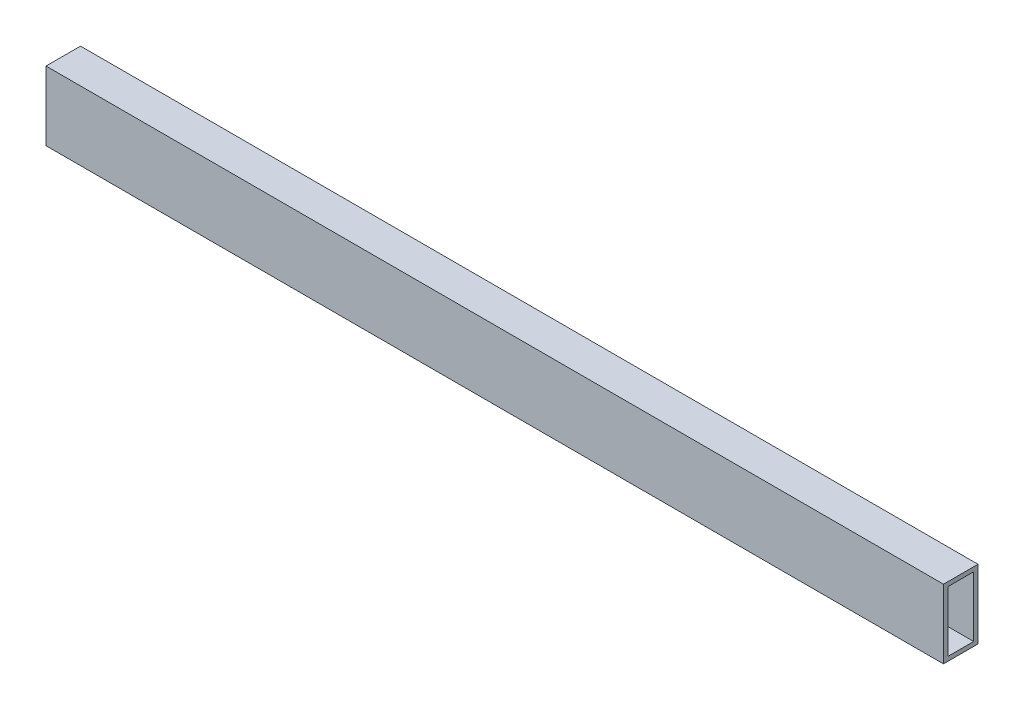
ISO-10303-21;
HEADER;
FILE_DESCRIPTION(('STEP AP214'),'2;1');
FILE_NAME('part.step','',(''),(''),'','','');
FILE_SCHEMA(('AUTOMOTIVE_DESIGN { 1 0 10303 214 1 1 1 1 }'));
ENDSEC;
DATA;
#1=APPLICATION_CONTEXT('core data for automotive mechanical design processes');
#2=APPLICATION_PROTOCOL_DEFINITION('international standard','automotive_design',2000,#1);
#3=PRODUCT_CONTEXT('',#1,'mechanical');
#4=PRODUCT('Part','Part','',(#3));
#5=PRODUCT_RELATED_PRODUCT_CATEGORY('part','',(#4));
#6=PRODUCT_DEFINITION_FORMATION('','',#4);
#7=PRODUCT_DEFINITION_CONTEXT('part definition',#1,'design');
#8=PRODUCT_DEFINITION('design','',#6,#7);
#9=PRODUCT_DEFINITION_SHAPE('','',#8);
#10=(LENGTH_UNIT() NAMED_UNIT(*) SI_UNIT(.MILLI.,.METRE.));
#11=(NAMED_UNIT(*) PLANE_ANGLE_UNIT() SI_UNIT($,.RADIAN.));
#12=(NAMED_UNIT(*) SI_UNIT($,.STERADIAN.) SOLID_ANGLE_UNIT());
#13=UNCERTAINTY_MEASURE_WITH_UNIT(LENGTH_MEASURE(1.E-05),#10,'distance_accuracy_value','');
#14=(GEOMETRIC_REPRESENTATION_CONTEXT(3) GLOBAL_UNCERTAINTY_ASSIGNED_CONTEXT((#13)) GLOBAL_UNIT_ASSIGNED_CONTEXT((#10,
#11,#12)) REPRESENTATION_CONTEXT('',''));
#15=CARTESIAN_POINT('',(0.,0.,0.));
#16=DIRECTION('',(0.,0.,1.));
#17=DIRECTION('',(1.,0.,0.));
#18=AXIS2_PLACEMENT_3D('',#15,#16,#17);
#19=CARTESIAN_POINT('',(330.2,25.4,-12.7));
#20=DIRECTION('',(-1.,0.,0.));
#21=DIRECTION('',(0.,0.,1.));
#22=AXIS2_PLACEMENT_3D('',#19,#20,#21);
#23=PLANE('',#22);
#24=DIRECTION('',(0.,0.,-1.));
#25=VECTOR('',#24,1.);
#26=CARTESIAN_POINT('',(330.2,-25.4,-12.7));
#27=LINE('',#26,#25);
#28=CARTESIAN_POINT('',(330.2,-25.4,12.7));
#29=VERTEX_POINT('',#28);
#30=CARTESIAN_POINT('',(330.2,-25.4,-12.7));
#31=VERTEX_POINT('',#30);
#32=EDGE_CURVE('E127',#29,#31,#27,.T.);
#33=ORIENTED_EDGE('',*,*,#32,.T.);
#34=DIRECTION('',(0.,-1.,0.));
#35=VECTOR('',#34,1.);
#36=CARTESIAN_POINT('',(330.2,25.4,-12.7));
#37=LINE('',#36,#35);
#38=CARTESIAN_POINT('',(330.2,25.4,-12.7));
#39=VERTEX_POINT('',#38);
#40=EDGE_CURVE('E11',#39,#31,#37,.T.);
#41=ORIENTED_EDGE('',*,*,#40,.F.);
#42=DIRECTION('',(0.,0.,-1.));
#43=VECTOR('',#42,1.);
#44=CARTESIAN_POINT('',(330.2,25.4,-12.7));
#45=LINE('',#44,#43);
#46=CARTESIAN_POINT('',(330.2,25.4,12.7));
#47=VERTEX_POINT('',#46);
#48=EDGE_CURVE('E132',#47,#39,#45,.T.);
#49=ORIENTED_EDGE('',*,*,#48,.F.);
#50=DIRECTION('',(0.,-1.,0.));
#51=VECTOR('',#50,1.);
#52=CARTESIAN_POINT('',(330.2,25.4,12.7));
#53=LINE('',#52,#51);
#54=EDGE_CURVE('E142',#47,#29,#53,.T.);
#55=ORIENTED_EDGE('',*,*,#54,.T.);
#56=EDGE_LOOP('',(#33,#41,#49,#55));
#57=FACE_BOUND('',#56,.T.);
#58=DIRECTION('',(0.,0.,-1.));
#59=VECTOR('',#58,1.);
#60=CARTESIAN_POINT('',(330.2,-22.225,-12.7));
#61=LINE('',#60,#59);
#62=CARTESIAN_POINT('',(330.2,-22.225,9.525));
#63=VERTEX_POINT('',#62);
#64=CARTESIAN_POINT('',(330.2,-22.225,-9.525));
#65=VERTEX_POINT('',#64);
#66=EDGE_CURVE('E103',#63,#65,#61,.T.);
#67=ORIENTED_EDGE('',*,*,#66,.F.);
#68=DIRECTION('',(0.,-1.,0.));
#69=VECTOR('',#68,1.);
#70=CARTESIAN_POINT('',(330.2,25.4,9.525));
#71=LINE('',#70,#69);
#72=CARTESIAN_POINT('',(330.2,22.225,9.525));
#73=VERTEX_POINT('',#72);
#74=EDGE_CURVE('E123',#73,#63,#71,.T.);
#75=ORIENTED_EDGE('',*,*,#74,.F.);
#76=DIRECTION('',(0.,0.,-1.));
#77=VECTOR('',#76,1.);
#78=CARTESIAN_POINT('',(330.2,22.225,-12.7));
#79=LINE('',#78,#77);
#80=CARTESIAN_POINT('',(330.2,22.225,-9.525));
#81=VERTEX_POINT('',#80);
#82=EDGE_CURVE('E47',#73,#81,#79,.T.);
#83=ORIENTED_EDGE('',*,*,#82,.T.);
#84=DIRECTION('',(0.,-1.,0.));
#85=VECTOR('',#84,1.);
#86=CARTESIAN_POINT('',(330.2,25.4,-9.525));
#87=LINE('',#86,#85);
#88=EDGE_CURVE('E113',#81,#65,#87,.T.);
#89=ORIENTED_EDGE('',*,*,#88,.T.);
#90=EDGE_LOOP('',(#67,#75,#83,#89));
#91=FACE_BOUND('',#90,.T.);
#92=ADVANCED_FACE('F33',(#57,#91),#23,.F.);
#93=CARTESIAN_POINT('',(-330.2,25.4,-12.7));
#94=DIRECTION('',(1.,0.,0.));
#95=DIRECTION('',(0.,0.,-1.));
#96=AXIS2_PLACEMENT_3D('',#93,#94,#95);
#97=PLANE('',#96);
#98=DIRECTION('',(0.,0.,1.));
#99=VECTOR('',#98,1.);
#100=CARTESIAN_POINT('',(-330.2,-25.4,-12.7));
#101=LINE('',#100,#99);
#102=CARTESIAN_POINT('',(-330.2,-25.4,-12.7));
#103=VERTEX_POINT('',#102);
#104=CARTESIAN_POINT('',(-330.2,-25.4,12.7));
#105=VERTEX_POINT('',#104);
#106=EDGE_CURVE('E147',#103,#105,#101,.T.);
#107=ORIENTED_EDGE('',*,*,#106,.T.);
#108=DIRECTION('',(0.,-1.,0.));
#109=VECTOR('',#108,1.);
#110=CARTESIAN_POINT('',(-330.2,25.4,12.7));
#111=LINE('',#110,#109);
#112=CARTESIAN_POINT('',(-330.2,25.4,12.7));
#113=VERTEX_POINT('',#112);
#114=EDGE_CURVE('E152',#113,#105,#111,.T.);
#115=ORIENTED_EDGE('',*,*,#114,.F.);
#116=DIRECTION('',(0.,0.,1.));
#117=VECTOR('',#116,1.);
#118=CARTESIAN_POINT('',(-330.2,25.4,-12.7));
#119=LINE('',#118,#117);
#120=CARTESIAN_POINT('',(-330.2,25.4,-12.7));
#121=VERTEX_POINT('',#120);
#122=EDGE_CURVE('E138',#121,#113,#119,.T.);
#123=ORIENTED_EDGE('',*,*,#122,.F.);
#124=DIRECTION('',(0.,-1.,0.));
#125=VECTOR('',#124,1.);
#126=CARTESIAN_POINT('',(-330.2,25.4,-12.7));
#127=LINE('',#126,#125);
#128=EDGE_CURVE('E40',#121,#103,#127,.T.);
#129=ORIENTED_EDGE('',*,*,#128,.T.);
#130=EDGE_LOOP('',(#107,#115,#123,#129));
#131=FACE_BOUND('',#130,.T.);
#132=DIRECTION('',(0.,0.,1.));
#133=VECTOR('',#132,1.);
#134=CARTESIAN_POINT('',(-330.2,-22.225,-12.7));
#135=LINE('',#134,#133);
#136=CARTESIAN_POINT('',(-330.2,-22.225,-9.525));
#137=VERTEX_POINT('',#136);
#138=CARTESIAN_POINT('',(-330.2,-22.225,9.525));
#139=VERTEX_POINT('',#138);
#140=EDGE_CURVE('E100',#137,#139,#135,.T.);
#141=ORIENTED_EDGE('',*,*,#140,.F.);
#142=DIRECTION('',(0.,-1.,0.));
#143=VECTOR('',#142,1.);
#144=CARTESIAN_POINT('',(-330.2,25.4,-9.525));
#145=LINE('',#144,#143);
#146=CARTESIAN_POINT('',(-330.2,22.225,-9.525));
#147=VERTEX_POINT('',#146);
#148=EDGE_CURVE('E109',#147,#137,#145,.T.);
#149=ORIENTED_EDGE('',*,*,#148,.F.);
#150=DIRECTION('',(0.,0.,1.));
#151=VECTOR('',#150,1.);
#152=CARTESIAN_POINT('',(-330.2,22.225,-12.7));
#153=LINE('',#152,#151);
#154=CARTESIAN_POINT('',(-330.2,22.225,9.525));
#155=VERTEX_POINT('',#154);
#156=EDGE_CURVE('E52',#147,#155,#153,.T.);
#157=ORIENTED_EDGE('',*,*,#156,.T.);
#158=DIRECTION('',(0.,-1.,0.));
#159=VECTOR('',#158,1.);
#160=CARTESIAN_POINT('',(-330.2,25.4,9.525));
#161=LINE('',#160,#159);
#162=EDGE_CURVE('E114',#155,#139,#161,.T.);
#163=ORIENTED_EDGE('',*,*,#162,.T.);
#164=EDGE_LOOP('',(#141,#149,#157,#163));
#165=FACE_BOUND('',#164,.T.);
#166=ADVANCED_FACE('F117',(#131,#165),#97,.F.);
#167=CARTESIAN_POINT('',(-330.2,25.4,-12.7));
#168=DIRECTION('',(0.,0.,1.));
#169=DIRECTION('',(1.,0.,0.));
#170=AXIS2_PLACEMENT_3D('',#167,#168,#169);
#171=PLANE('',#170);
#172=DIRECTION('',(-1.,0.,0.));
#173=VECTOR('',#172,1.);
#174=CARTESIAN_POINT('',(-330.2,-25.4,-12.7));
#175=LINE('',#174,#173);
#176=EDGE_CURVE('E145',#31,#103,#175,.T.);
#177=ORIENTED_EDGE('',*,*,#176,.T.);
#178=ORIENTED_EDGE('',*,*,#128,.F.);
#179=DIRECTION('',(-1.,0.,0.));
#180=VECTOR('',#179,1.);
#181=CARTESIAN_POINT('',(-330.2,25.4,-12.7));
#182=LINE('',#181,#180);
#183=EDGE_CURVE('E135',#39,#121,#182,.T.);
#184=ORIENTED_EDGE('',*,*,#183,.F.);
#185=ORIENTED_EDGE('',*,*,#40,.T.);
#186=EDGE_LOOP('',(#177,#178,#184,#185));
#187=FACE_BOUND('',#186,.T.);
#188=ADVANCED_FACE('F175',(#187),#171,.F.);
#189=CARTESIAN_POINT('',(-330.2,25.4,12.7));
#190=DIRECTION('',(0.,0.,-1.));
#191=DIRECTION('',(-1.,0.,0.));
#192=AXIS2_PLACEMENT_3D('',#189,#190,#191);
#193=PLANE('',#192);
#194=DIRECTION('',(1.,0.,0.));
#195=VECTOR('',#194,1.);
#196=CARTESIAN_POINT('',(-330.2,-25.4,12.7));
#197=LINE('',#196,#195);
#198=EDGE_CURVE('E136',#105,#29,#197,.T.);
#199=ORIENTED_EDGE('',*,*,#198,.T.);
#200=ORIENTED_EDGE('',*,*,#54,.F.);
#201=DIRECTION('',(1.,0.,0.));
#202=VECTOR('',#201,1.);
#203=CARTESIAN_POINT('',(-330.2,25.4,12.7));
#204=LINE('',#203,#202);
#205=EDGE_CURVE('E140',#113,#47,#204,.T.);
#206=ORIENTED_EDGE('',*,*,#205,.F.);
#207=ORIENTED_EDGE('',*,*,#114,.T.);
#208=EDGE_LOOP('',(#199,#200,#206,#207));
#209=FACE_BOUND('',#208,.T.);
#210=ADVANCED_FACE('F167',(#209),#193,.F.);
#211=CARTESIAN_POINT('',(0.,25.4,0.));
#212=DIRECTION('',(0.,1.,0.));
#213=DIRECTION('',(0.,0.,1.));
#214=AXIS2_PLACEMENT_3D('',#211,#212,#213);
#215=PLANE('',#214);
#216=ORIENTED_EDGE('',*,*,#48,.T.);
#217=ORIENTED_EDGE('',*,*,#183,.T.);
#218=ORIENTED_EDGE('',*,*,#122,.T.);
#219=ORIENTED_EDGE('',*,*,#205,.T.);
#220=EDGE_LOOP('',(#216,#217,#218,#219));
#221=FACE_BOUND('',#220,.T.);
#222=ADVANCED_FACE('F174',(#221),#215,.T.);
#223=CARTESIAN_POINT('',(0.,-25.4,0.));
#224=DIRECTION('',(0.,1.,0.));
#225=DIRECTION('',(0.,0.,1.));
#226=AXIS2_PLACEMENT_3D('',#223,#224,#225);
#227=PLANE('',#226);
#228=ORIENTED_EDGE('',*,*,#32,.F.);
#229=ORIENTED_EDGE('',*,*,#198,.F.);
#230=ORIENTED_EDGE('',*,*,#106,.F.);
#231=ORIENTED_EDGE('',*,*,#176,.F.);
#232=EDGE_LOOP('',(#228,#229,#230,#231));
#233=FACE_BOUND('',#232,.T.);
#234=ADVANCED_FACE('F164',(#233),#227,.F.);
#235=CARTESIAN_POINT('',(-330.2,25.4,-9.525));
#236=DIRECTION('',(0.,0.,1.));
#237=DIRECTION('',(1.,0.,0.));
#238=AXIS2_PLACEMENT_3D('',#235,#236,#237);
#239=PLANE('',#238);
#240=DIRECTION('',(-1.,0.,0.));
#241=VECTOR('',#240,1.);
#242=CARTESIAN_POINT('',(-330.2,-22.225,-9.525));
#243=LINE('',#242,#241);
#244=EDGE_CURVE('E96',#65,#137,#243,.T.);
#245=ORIENTED_EDGE('',*,*,#244,.F.);
#246=ORIENTED_EDGE('',*,*,#88,.F.);
#247=DIRECTION('',(-1.,0.,0.));
#248=VECTOR('',#247,1.);
#249=CARTESIAN_POINT('',(-330.2,22.225,-9.525));
#250=LINE('',#249,#248);
#251=EDGE_CURVE('E111',#81,#147,#250,.T.);
#252=ORIENTED_EDGE('',*,*,#251,.T.);
#253=ORIENTED_EDGE('',*,*,#148,.T.);
#254=EDGE_LOOP('',(#245,#246,#252,#253));
#255=FACE_BOUND('',#254,.T.);
#256=ADVANCED_FACE('F110',(#255),#239,.T.);
#257=CARTESIAN_POINT('',(-330.2,25.4,9.525));
#258=DIRECTION('',(0.,0.,-1.));
#259=DIRECTION('',(-1.,0.,0.));
#260=AXIS2_PLACEMENT_3D('',#257,#258,#259);
#261=PLANE('',#260);
#262=DIRECTION('',(1.,0.,0.));
#263=VECTOR('',#262,1.);
#264=CARTESIAN_POINT('',(-330.2,-22.225,9.525));
#265=LINE('',#264,#263);
#266=EDGE_CURVE('E118',#139,#63,#265,.T.);
#267=ORIENTED_EDGE('',*,*,#266,.F.);
#268=ORIENTED_EDGE('',*,*,#162,.F.);
#269=DIRECTION('',(1.,0.,0.));
#270=VECTOR('',#269,1.);
#271=CARTESIAN_POINT('',(-330.2,22.225,9.525));
#272=LINE('',#271,#270);
#273=EDGE_CURVE('E125',#155,#73,#272,.T.);
#274=ORIENTED_EDGE('',*,*,#273,.T.);
#275=ORIENTED_EDGE('',*,*,#74,.T.);
#276=EDGE_LOOP('',(#267,#268,#274,#275));
#277=FACE_BOUND('',#276,.T.);
#278=ADVANCED_FACE('F201',(#277),#261,.T.);
#279=CARTESIAN_POINT('',(0.,22.225,0.));
#280=DIRECTION('',(0.,1.,0.));
#281=DIRECTION('',(0.,0.,1.));
#282=AXIS2_PLACEMENT_3D('',#279,#280,#281);
#283=PLANE('',#282);
#284=ORIENTED_EDGE('',*,*,#82,.F.);
#285=ORIENTED_EDGE('',*,*,#273,.F.);
#286=ORIENTED_EDGE('',*,*,#156,.F.);
#287=ORIENTED_EDGE('',*,*,#251,.F.);
#288=EDGE_LOOP('',(#284,#285,#286,#287));
#289=FACE_BOUND('',#288,.T.);
#290=ADVANCED_FACE('F211',(#289),#283,.F.);
#291=CARTESIAN_POINT('',(0.,-22.225,0.));
#292=DIRECTION('',(0.,1.,0.));
#293=DIRECTION('',(0.,0.,1.));
#294=AXIS2_PLACEMENT_3D('',#291,#292,#293);
#295=PLANE('',#294);
#296=ORIENTED_EDGE('',*,*,#66,.T.);
#297=ORIENTED_EDGE('',*,*,#244,.T.);
#298=ORIENTED_EDGE('',*,*,#140,.T.);
#299=ORIENTED_EDGE('',*,*,#266,.T.);
#300=EDGE_LOOP('',(#296,#297,#298,#299));
#301=FACE_BOUND('',#300,.T.);
#302=ADVANCED_FACE('F98',(#301),#295,.T.);
#303=CLOSED_SHELL('',(#92,#166,#188,#210,#222,#234,#256,#278,#290,#302));
#304=MANIFOLD_SOLID_BREP('B2',#303);
#305=ADVANCED_BREP_SHAPE_REPRESENTATION('',(#18,#304),#14);
#306=SHAPE_DEFINITION_REPRESENTATION(#9,#305);
ENDSEC;
END-ISO-10303-21;
